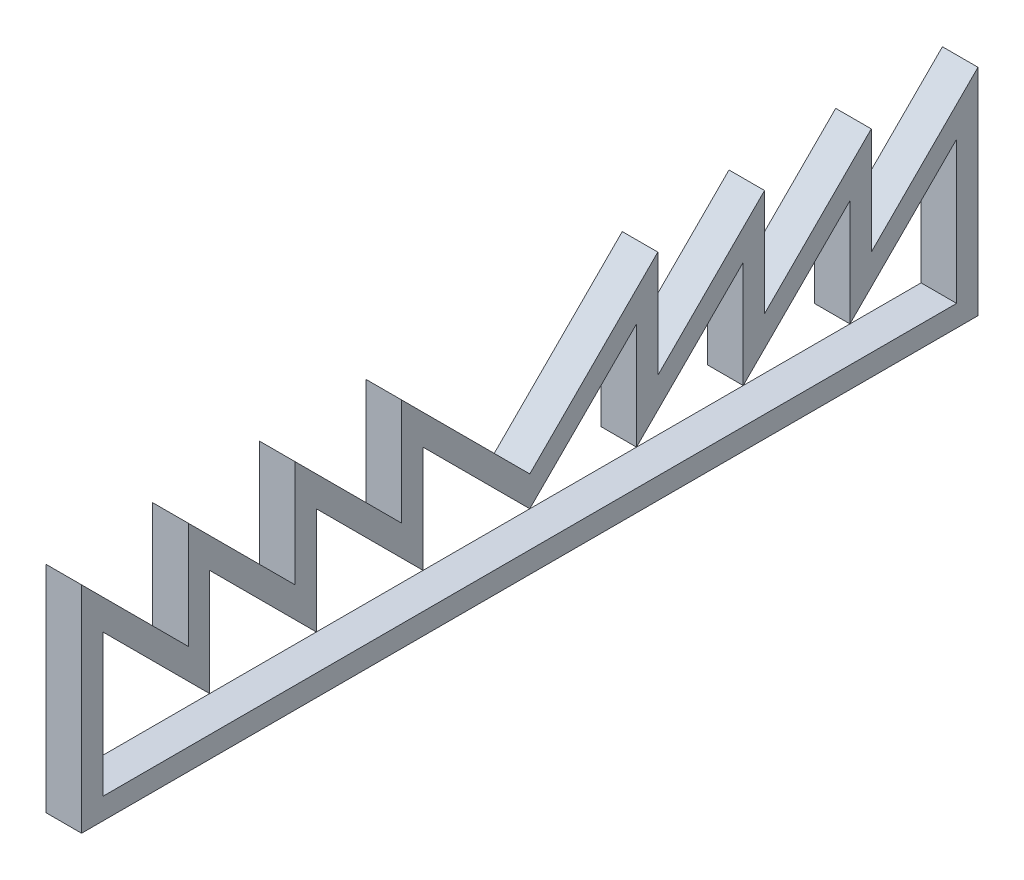
ISO-10303-21;
HEADER;
FILE_DESCRIPTION(('STEP AP214'),'2;1');
FILE_NAME('part.step','',(''),(''),'','','');
FILE_SCHEMA(('AUTOMOTIVE_DESIGN { 1 0 10303 214 1 1 1 1 }'));
ENDSEC;
DATA;
#1=APPLICATION_CONTEXT('core data for automotive mechanical design processes');
#2=APPLICATION_PROTOCOL_DEFINITION('international standard','automotive_design',2000,#1);
#3=PRODUCT_CONTEXT('',#1,'mechanical');
#4=PRODUCT('Part','Part','',(#3));
#5=PRODUCT_RELATED_PRODUCT_CATEGORY('part','',(#4));
#6=PRODUCT_DEFINITION_FORMATION('','',#4);
#7=PRODUCT_DEFINITION_CONTEXT('part definition',#1,'design');
#8=PRODUCT_DEFINITION('design','',#6,#7);
#9=PRODUCT_DEFINITION_SHAPE('','',#8);
#10=(LENGTH_UNIT() NAMED_UNIT(*) SI_UNIT(.MILLI.,.METRE.));
#11=(NAMED_UNIT(*) PLANE_ANGLE_UNIT() SI_UNIT($,.RADIAN.));
#12=(NAMED_UNIT(*) SI_UNIT($,.STERADIAN.) SOLID_ANGLE_UNIT());
#13=UNCERTAINTY_MEASURE_WITH_UNIT(LENGTH_MEASURE(1.E-05),#10,'distance_accuracy_value','');
#14=(GEOMETRIC_REPRESENTATION_CONTEXT(3) GLOBAL_UNCERTAINTY_ASSIGNED_CONTEXT((#13)) GLOBAL_UNIT_ASSIGNED_CONTEXT((#10,
#11,#12)) REPRESENTATION_CONTEXT('',''));
#15=CARTESIAN_POINT('',(0.,0.,0.));
#16=DIRECTION('',(0.,0.,1.));
#17=DIRECTION('',(1.,0.,0.));
#18=AXIS2_PLACEMENT_3D('',#15,#16,#17);
#19=CARTESIAN_POINT('',(12.7,0.,0.));
#20=DIRECTION('',(-1.,0.,0.));
#21=DIRECTION('',(0.,0.,1.));
#22=AXIS2_PLACEMENT_3D('',#19,#20,#21);
#23=PLANE('',#22);
#24=DIRECTION('',(0.,0.,-1.));
#25=VECTOR('',#24,1.);
#26=CARTESIAN_POINT('',(12.7,-7.62,-160.02));
#27=LINE('',#26,#25);
#28=CARTESIAN_POINT('',(12.7,-7.62,160.02));
#29=VERTEX_POINT('',#28);
#30=CARTESIAN_POINT('',(12.7,-7.62,-160.02));
#31=VERTEX_POINT('',#30);
#32=EDGE_CURVE('E382',#29,#31,#27,.T.);
#33=ORIENTED_EDGE('',*,*,#32,.T.);
#34=DIRECTION('',(0.,1.,0.));
#35=VECTOR('',#34,1.);
#36=CARTESIAN_POINT('',(12.7,-7.62,-160.02));
#37=LINE('',#36,#35);
#38=CARTESIAN_POINT('',(12.7,69.1963073452835,-160.02));
#39=VERTEX_POINT('',#38);
#40=EDGE_CURVE('E385',#31,#39,#37,.T.);
#41=ORIENTED_EDGE('',*,*,#40,.T.);
#42=DIRECTION('',(0.,-0.707106781186551,0.707106781186544));
#43=VECTOR('',#42,1.);
#44=CARTESIAN_POINT('',(12.7,69.1963073452835,-160.02));
#45=LINE('',#44,#43);
#46=CARTESIAN_POINT('',(12.7,31.0963073452831,-121.92));
#47=VERTEX_POINT('',#46);
#48=EDGE_CURVE('E388',#39,#47,#45,.T.);
#49=ORIENTED_EDGE('',*,*,#48,.T.);
#50=DIRECTION('',(0.,1.,0.));
#51=VECTOR('',#50,1.);
#52=CARTESIAN_POINT('',(12.7,31.0963073452831,-121.92));
#53=LINE('',#52,#51);
#54=CARTESIAN_POINT('',(12.7,69.1963073452836,-121.92));
#55=VERTEX_POINT('',#54);
#56=EDGE_CURVE('E390',#47,#55,#53,.T.);
#57=ORIENTED_EDGE('',*,*,#56,.T.);
#58=DIRECTION('',(0.,-0.707106781186551,0.707106781186544));
#59=VECTOR('',#58,1.);
#60=CARTESIAN_POINT('',(12.7,69.1963073452836,-121.92));
#61=LINE('',#60,#59);
#62=CARTESIAN_POINT('',(12.7,31.0963073452831,-83.82));
#63=VERTEX_POINT('',#62);
#64=EDGE_CURVE('E392',#55,#63,#61,.T.);
#65=ORIENTED_EDGE('',*,*,#64,.T.);
#66=DIRECTION('',(0.,1.,0.));
#67=VECTOR('',#66,1.);
#68=CARTESIAN_POINT('',(12.7,31.0963073452831,-83.82));
#69=LINE('',#68,#67);
#70=CARTESIAN_POINT('',(12.7,69.1963073452835,-83.82));
#71=VERTEX_POINT('',#70);
#72=EDGE_CURVE('E394',#63,#71,#69,.T.);
#73=ORIENTED_EDGE('',*,*,#72,.T.);
#74=DIRECTION('',(0.,-0.707106781186551,0.707106781186544));
#75=VECTOR('',#74,1.);
#76=CARTESIAN_POINT('',(12.7,69.1963073452835,-83.82));
#77=LINE('',#76,#75);
#78=CARTESIAN_POINT('',(12.7,31.0963073452831,-45.72));
#79=VERTEX_POINT('',#78);
#80=EDGE_CURVE('E396',#71,#79,#77,.T.);
#81=ORIENTED_EDGE('',*,*,#80,.T.);
#82=DIRECTION('',(0.,1.,0.));
#83=VECTOR('',#82,1.);
#84=CARTESIAN_POINT('',(12.7,31.0963073452831,-45.72));
#85=LINE('',#84,#83);
#86=CARTESIAN_POINT('',(12.7,69.1963073452835,-45.72));
#87=VERTEX_POINT('',#86);
#88=EDGE_CURVE('E398',#79,#87,#85,.T.);
#89=ORIENTED_EDGE('',*,*,#88,.T.);
#90=DIRECTION('',(0.,-0.707106781186551,0.707106781186544));
#91=VECTOR('',#90,1.);
#92=CARTESIAN_POINT('',(12.7,69.1963073452835,-45.72));
#93=LINE('',#92,#91);
#94=CARTESIAN_POINT('',(12.7,23.476307345283,0.));
#95=VERTEX_POINT('',#94);
#96=EDGE_CURVE('E400',#87,#95,#93,.T.);
#97=ORIENTED_EDGE('',*,*,#96,.T.);
#98=DIRECTION('',(0.,0.707106781186551,0.707106781186544));
#99=VECTOR('',#98,1.);
#100=CARTESIAN_POINT('',(12.7,69.1963073452835,45.72));
#101=LINE('',#100,#99);
#102=CARTESIAN_POINT('',(12.7,69.1963073452835,45.72));
#103=VERTEX_POINT('',#102);
#104=EDGE_CURVE('E402',#95,#103,#101,.T.);
#105=ORIENTED_EDGE('',*,*,#104,.T.);
#106=DIRECTION('',(0.,-1.,0.));
#107=VECTOR('',#106,1.);
#108=CARTESIAN_POINT('',(12.7,31.0963073452831,45.72));
#109=LINE('',#108,#107);
#110=CARTESIAN_POINT('',(12.7,31.0963073452831,45.72));
#111=VERTEX_POINT('',#110);
#112=EDGE_CURVE('E404',#103,#111,#109,.T.);
#113=ORIENTED_EDGE('',*,*,#112,.T.);
#114=DIRECTION('',(0.,0.707106781186551,0.707106781186544));
#115=VECTOR('',#114,1.);
#116=CARTESIAN_POINT('',(12.7,69.1963073452835,83.82));
#117=LINE('',#116,#115);
#118=CARTESIAN_POINT('',(12.7,69.1963073452835,83.82));
#119=VERTEX_POINT('',#118);
#120=EDGE_CURVE('E406',#111,#119,#117,.T.);
#121=ORIENTED_EDGE('',*,*,#120,.T.);
#122=DIRECTION('',(0.,-1.,0.));
#123=VECTOR('',#122,1.);
#124=CARTESIAN_POINT('',(12.7,31.0963073452831,83.82));
#125=LINE('',#124,#123);
#126=CARTESIAN_POINT('',(12.7,31.0963073452831,83.82));
#127=VERTEX_POINT('',#126);
#128=EDGE_CURVE('E408',#119,#127,#125,.T.);
#129=ORIENTED_EDGE('',*,*,#128,.T.);
#130=DIRECTION('',(0.,0.707106781186551,0.707106781186544));
#131=VECTOR('',#130,1.);
#132=CARTESIAN_POINT('',(12.7,69.1963073452835,121.92));
#133=LINE('',#132,#131);
#134=CARTESIAN_POINT('',(12.7,69.1963073452835,121.92));
#135=VERTEX_POINT('',#134);
#136=EDGE_CURVE('E410',#127,#135,#133,.T.);
#137=ORIENTED_EDGE('',*,*,#136,.T.);
#138=DIRECTION('',(0.,-1.,0.));
#139=VECTOR('',#138,1.);
#140=CARTESIAN_POINT('',(12.7,31.0963073452831,121.92));
#141=LINE('',#140,#139);
#142=CARTESIAN_POINT('',(12.7,31.0963073452831,121.92));
#143=VERTEX_POINT('',#142);
#144=EDGE_CURVE('E412',#135,#143,#141,.T.);
#145=ORIENTED_EDGE('',*,*,#144,.T.);
#146=DIRECTION('',(0.,0.707106781186551,0.707106781186544));
#147=VECTOR('',#146,1.);
#148=CARTESIAN_POINT('',(12.7,69.1963073452835,160.02));
#149=LINE('',#148,#147);
#150=CARTESIAN_POINT('',(12.7,69.1963073452835,160.02));
#151=VERTEX_POINT('',#150);
#152=EDGE_CURVE('E414',#143,#151,#149,.T.);
#153=ORIENTED_EDGE('',*,*,#152,.T.);
#154=DIRECTION('',(0.,-1.,0.));
#155=VECTOR('',#154,1.);
#156=CARTESIAN_POINT('',(12.7,-7.62,160.02));
#157=LINE('',#156,#155);
#158=EDGE_CURVE('E416',#151,#29,#157,.T.);
#159=ORIENTED_EDGE('',*,*,#158,.T.);
#160=EDGE_LOOP('',(#33,#41,#49,#57,#65,#73,#81,#89,#97,#105,#113,#121,#129,#137,#145,#153,#159));
#161=FACE_BOUND('',#160,.T.);
#162=DIRECTION('',(0.,-1.,0.));
#163=VECTOR('',#162,1.);
#164=CARTESIAN_POINT('',(12.7,0.,152.4));
#165=LINE('',#164,#163);
#166=CARTESIAN_POINT('',(12.7,50.8000000000004,152.4));
#167=VERTEX_POINT('',#166);
#168=CARTESIAN_POINT('',(12.7,0.,152.4));
#169=VERTEX_POINT('',#168);
#170=EDGE_CURVE('E254',#167,#169,#165,.T.);
#171=ORIENTED_EDGE('',*,*,#170,.F.);
#172=DIRECTION('',(0.,0.707106781186551,0.707106781186543));
#173=VECTOR('',#172,1.);
#174=CARTESIAN_POINT('',(12.7,50.8000000000004,152.4));
#175=LINE('',#174,#173);
#176=CARTESIAN_POINT('',(12.7,12.7,114.3));
#177=VERTEX_POINT('',#176);
#178=EDGE_CURVE('E305',#177,#167,#175,.T.);
#179=ORIENTED_EDGE('',*,*,#178,.F.);
#180=DIRECTION('',(0.,-1.,0.));
#181=VECTOR('',#180,1.);
#182=CARTESIAN_POINT('',(12.7,12.7,114.3));
#183=LINE('',#182,#181);
#184=CARTESIAN_POINT('',(12.7,50.8000000000004,114.3));
#185=VERTEX_POINT('',#184);
#186=EDGE_CURVE('E303',#185,#177,#183,.T.);
#187=ORIENTED_EDGE('',*,*,#186,.F.);
#188=DIRECTION('',(0.,0.707106781186551,0.707106781186544));
#189=VECTOR('',#188,1.);
#190=CARTESIAN_POINT('',(12.7,50.8000000000004,114.3));
#191=LINE('',#190,#189);
#192=CARTESIAN_POINT('',(12.7,12.7,76.2));
#193=VERTEX_POINT('',#192);
#194=EDGE_CURVE('E301',#193,#185,#191,.T.);
#195=ORIENTED_EDGE('',*,*,#194,.F.);
#196=DIRECTION('',(0.,-1.,0.));
#197=VECTOR('',#196,1.);
#198=CARTESIAN_POINT('',(12.7,12.7,76.2));
#199=LINE('',#198,#197);
#200=CARTESIAN_POINT('',(12.7,50.8000000000004,76.2));
#201=VERTEX_POINT('',#200);
#202=EDGE_CURVE('E299',#201,#193,#199,.T.);
#203=ORIENTED_EDGE('',*,*,#202,.F.);
#204=DIRECTION('',(0.,0.707106781186551,0.707106781186544));
#205=VECTOR('',#204,1.);
#206=CARTESIAN_POINT('',(12.7,50.8000000000004,76.2));
#207=LINE('',#206,#205);
#208=CARTESIAN_POINT('',(12.7,12.7,38.1));
#209=VERTEX_POINT('',#208);
#210=EDGE_CURVE('E297',#209,#201,#207,.T.);
#211=ORIENTED_EDGE('',*,*,#210,.F.);
#212=DIRECTION('',(0.,-1.,0.));
#213=VECTOR('',#212,1.);
#214=CARTESIAN_POINT('',(12.7,12.7,38.1));
#215=LINE('',#214,#213);
#216=CARTESIAN_POINT('',(12.7,50.8000000000004,38.1));
#217=VERTEX_POINT('',#216);
#218=EDGE_CURVE('E295',#217,#209,#215,.T.);
#219=ORIENTED_EDGE('',*,*,#218,.F.);
#220=DIRECTION('',(0.,0.707106781186551,0.707106781186544));
#221=VECTOR('',#220,1.);
#222=CARTESIAN_POINT('',(12.7,50.8000000000004,38.1));
#223=LINE('',#222,#221);
#224=CARTESIAN_POINT('',(12.7,12.7,0.));
#225=VERTEX_POINT('',#224);
#226=EDGE_CURVE('E293',#225,#217,#223,.T.);
#227=ORIENTED_EDGE('',*,*,#226,.F.);
#228=DIRECTION('',(0.,-0.707106781186551,0.707106781186544));
#229=VECTOR('',#228,1.);
#230=CARTESIAN_POINT('',(12.7,50.8000000000004,-38.1));
#231=LINE('',#230,#229);
#232=CARTESIAN_POINT('',(12.7,50.8000000000004,-38.1));
#233=VERTEX_POINT('',#232);
#234=EDGE_CURVE('E291',#233,#225,#231,.T.);
#235=ORIENTED_EDGE('',*,*,#234,.F.);
#236=DIRECTION('',(0.,1.,0.));
#237=VECTOR('',#236,1.);
#238=CARTESIAN_POINT('',(12.7,12.7,-38.1));
#239=LINE('',#238,#237);
#240=CARTESIAN_POINT('',(12.7,12.7,-38.1));
#241=VERTEX_POINT('',#240);
#242=EDGE_CURVE('E289',#241,#233,#239,.T.);
#243=ORIENTED_EDGE('',*,*,#242,.F.);
#244=DIRECTION('',(0.,-0.707106781186551,0.707106781186544));
#245=VECTOR('',#244,1.);
#246=CARTESIAN_POINT('',(12.7,50.8000000000004,-76.2));
#247=LINE('',#246,#245);
#248=CARTESIAN_POINT('',(12.7,50.8000000000004,-76.2));
#249=VERTEX_POINT('',#248);
#250=EDGE_CURVE('E287',#249,#241,#247,.T.);
#251=ORIENTED_EDGE('',*,*,#250,.F.);
#252=DIRECTION('',(0.,1.,0.));
#253=VECTOR('',#252,1.);
#254=CARTESIAN_POINT('',(12.7,12.7,-76.2));
#255=LINE('',#254,#253);
#256=CARTESIAN_POINT('',(12.7,12.7,-76.2));
#257=VERTEX_POINT('',#256);
#258=EDGE_CURVE('E285',#257,#249,#255,.T.);
#259=ORIENTED_EDGE('',*,*,#258,.F.);
#260=DIRECTION('',(0.,-0.707106781186551,0.707106781186544));
#261=VECTOR('',#260,1.);
#262=CARTESIAN_POINT('',(12.7,50.8000000000004,-114.3));
#263=LINE('',#262,#261);
#264=CARTESIAN_POINT('',(12.7,50.8000000000004,-114.3));
#265=VERTEX_POINT('',#264);
#266=EDGE_CURVE('E283',#265,#257,#263,.T.);
#267=ORIENTED_EDGE('',*,*,#266,.F.);
#268=DIRECTION('',(0.,1.,0.));
#269=VECTOR('',#268,1.);
#270=CARTESIAN_POINT('',(12.7,12.7,-114.3));
#271=LINE('',#270,#269);
#272=CARTESIAN_POINT('',(12.7,12.7,-114.3));
#273=VERTEX_POINT('',#272);
#274=EDGE_CURVE('E281',#273,#265,#271,.T.);
#275=ORIENTED_EDGE('',*,*,#274,.F.);
#276=DIRECTION('',(0.,-0.707106781186551,0.707106781186543));
#277=VECTOR('',#276,1.);
#278=CARTESIAN_POINT('',(12.7,50.8000000000004,-152.4));
#279=LINE('',#278,#277);
#280=CARTESIAN_POINT('',(12.7,50.8000000000004,-152.4));
#281=VERTEX_POINT('',#280);
#282=EDGE_CURVE('E277',#281,#273,#279,.T.);
#283=ORIENTED_EDGE('',*,*,#282,.F.);
#284=DIRECTION('',(0.,1.,0.));
#285=VECTOR('',#284,1.);
#286=CARTESIAN_POINT('',(12.7,0.,-152.4));
#287=LINE('',#286,#285);
#288=CARTESIAN_POINT('',(12.7,0.,-152.4));
#289=VERTEX_POINT('',#288);
#290=EDGE_CURVE('E275',#289,#281,#287,.T.);
#291=ORIENTED_EDGE('',*,*,#290,.F.);
#292=DIRECTION('',(0.,0.,-1.));
#293=VECTOR('',#292,1.);
#294=CARTESIAN_POINT('',(12.7,0.,-152.4));
#295=LINE('',#294,#293);
#296=EDGE_CURVE('E262',#169,#289,#295,.T.);
#297=ORIENTED_EDGE('',*,*,#296,.F.);
#298=EDGE_LOOP('',(#171,#179,#187,#195,#203,#211,#219,#227,#235,#243,#251,#259,#267,#275,#283,
#291,#297));
#299=FACE_BOUND('',#298,.T.);
#300=ADVANCED_FACE('F33',(#161,#299),#23,.F.);
#301=CARTESIAN_POINT('',(0.,0.,0.));
#302=DIRECTION('',(-1.,0.,0.));
#303=DIRECTION('',(0.,0.,1.));
#304=AXIS2_PLACEMENT_3D('',#301,#302,#303);
#305=PLANE('',#304);
#306=DIRECTION('',(0.,0.,-1.));
#307=VECTOR('',#306,1.);
#308=CARTESIAN_POINT('',(0.,-7.62,-160.02));
#309=LINE('',#308,#307);
#310=CARTESIAN_POINT('',(0.,-7.62,160.02));
#311=VERTEX_POINT('',#310);
#312=CARTESIAN_POINT('',(0.,-7.62,-160.02));
#313=VERTEX_POINT('',#312);
#314=EDGE_CURVE('E270',#311,#313,#309,.T.);
#315=ORIENTED_EDGE('',*,*,#314,.F.);
#316=DIRECTION('',(0.,-1.,0.));
#317=VECTOR('',#316,1.);
#318=CARTESIAN_POINT('',(0.,-7.62,160.02));
#319=LINE('',#318,#317);
#320=CARTESIAN_POINT('',(0.,69.1963073452835,160.02));
#321=VERTEX_POINT('',#320);
#322=EDGE_CURVE('E386',#321,#311,#319,.T.);
#323=ORIENTED_EDGE('',*,*,#322,.F.);
#324=DIRECTION('',(0.,0.707106781186551,0.707106781186544));
#325=VECTOR('',#324,1.);
#326=CARTESIAN_POINT('',(0.,69.1963073452835,160.02));
#327=LINE('',#326,#325);
#328=CARTESIAN_POINT('',(0.,31.0963073452831,121.92));
#329=VERTEX_POINT('',#328);
#330=EDGE_CURVE('E449',#329,#321,#327,.T.);
#331=ORIENTED_EDGE('',*,*,#330,.F.);
#332=DIRECTION('',(0.,-1.,0.));
#333=VECTOR('',#332,1.);
#334=CARTESIAN_POINT('',(0.,31.0963073452831,121.92));
#335=LINE('',#334,#333);
#336=CARTESIAN_POINT('',(0.,69.1963073452835,121.92));
#337=VERTEX_POINT('',#336);
#338=EDGE_CURVE('E447',#337,#329,#335,.T.);
#339=ORIENTED_EDGE('',*,*,#338,.F.);
#340=DIRECTION('',(0.,0.707106781186551,0.707106781186544));
#341=VECTOR('',#340,1.);
#342=CARTESIAN_POINT('',(0.,69.1963073452835,121.92));
#343=LINE('',#342,#341);
#344=CARTESIAN_POINT('',(0.,31.0963073452831,83.82));
#345=VERTEX_POINT('',#344);
#346=EDGE_CURVE('E445',#345,#337,#343,.T.);
#347=ORIENTED_EDGE('',*,*,#346,.F.);
#348=DIRECTION('',(0.,-1.,0.));
#349=VECTOR('',#348,1.);
#350=CARTESIAN_POINT('',(0.,31.0963073452831,83.82));
#351=LINE('',#350,#349);
#352=CARTESIAN_POINT('',(0.,69.1963073452835,83.82));
#353=VERTEX_POINT('',#352);
#354=EDGE_CURVE('E443',#353,#345,#351,.T.);
#355=ORIENTED_EDGE('',*,*,#354,.F.);
#356=DIRECTION('',(0.,0.707106781186551,0.707106781186544));
#357=VECTOR('',#356,1.);
#358=CARTESIAN_POINT('',(0.,69.1963073452835,83.82));
#359=LINE('',#358,#357);
#360=CARTESIAN_POINT('',(0.,31.0963073452831,45.72));
#361=VERTEX_POINT('',#360);
#362=EDGE_CURVE('E441',#361,#353,#359,.T.);
#363=ORIENTED_EDGE('',*,*,#362,.F.);
#364=DIRECTION('',(0.,-1.,0.));
#365=VECTOR('',#364,1.);
#366=CARTESIAN_POINT('',(0.,31.0963073452831,45.72));
#367=LINE('',#366,#365);
#368=CARTESIAN_POINT('',(0.,69.1963073452835,45.72));
#369=VERTEX_POINT('',#368);
#370=EDGE_CURVE('E439',#369,#361,#367,.T.);
#371=ORIENTED_EDGE('',*,*,#370,.F.);
#372=DIRECTION('',(0.,0.707106781186551,0.707106781186544));
#373=VECTOR('',#372,1.);
#374=CARTESIAN_POINT('',(0.,69.1963073452835,45.72));
#375=LINE('',#374,#373);
#376=CARTESIAN_POINT('',(0.,23.476307345283,0.));
#377=VERTEX_POINT('',#376);
#378=EDGE_CURVE('E437',#377,#369,#375,.T.);
#379=ORIENTED_EDGE('',*,*,#378,.F.);
#380=DIRECTION('',(0.,-0.707106781186551,0.707106781186544));
#381=VECTOR('',#380,1.);
#382=CARTESIAN_POINT('',(0.,69.1963073452835,-45.72));
#383=LINE('',#382,#381);
#384=CARTESIAN_POINT('',(0.,69.1963073452835,-45.72));
#385=VERTEX_POINT('',#384);
#386=EDGE_CURVE('E435',#385,#377,#383,.T.);
#387=ORIENTED_EDGE('',*,*,#386,.F.);
#388=DIRECTION('',(0.,1.,0.));
#389=VECTOR('',#388,1.);
#390=CARTESIAN_POINT('',(0.,31.0963073452831,-45.72));
#391=LINE('',#390,#389);
#392=CARTESIAN_POINT('',(0.,31.0963073452831,-45.72));
#393=VERTEX_POINT('',#392);
#394=EDGE_CURVE('E433',#393,#385,#391,.T.);
#395=ORIENTED_EDGE('',*,*,#394,.F.);
#396=DIRECTION('',(0.,-0.707106781186551,0.707106781186544));
#397=VECTOR('',#396,1.);
#398=CARTESIAN_POINT('',(0.,69.1963073452835,-83.82));
#399=LINE('',#398,#397);
#400=CARTESIAN_POINT('',(0.,69.1963073452835,-83.82));
#401=VERTEX_POINT('',#400);
#402=EDGE_CURVE('E431',#401,#393,#399,.T.);
#403=ORIENTED_EDGE('',*,*,#402,.F.);
#404=DIRECTION('',(0.,1.,0.));
#405=VECTOR('',#404,1.);
#406=CARTESIAN_POINT('',(0.,31.0963073452831,-83.82));
#407=LINE('',#406,#405);
#408=CARTESIAN_POINT('',(0.,31.0963073452831,-83.82));
#409=VERTEX_POINT('',#408);
#410=EDGE_CURVE('E429',#409,#401,#407,.T.);
#411=ORIENTED_EDGE('',*,*,#410,.F.);
#412=DIRECTION('',(0.,-0.707106781186551,0.707106781186544));
#413=VECTOR('',#412,1.);
#414=CARTESIAN_POINT('',(0.,69.1963073452836,-121.92));
#415=LINE('',#414,#413);
#416=CARTESIAN_POINT('',(0.,69.1963073452836,-121.92));
#417=VERTEX_POINT('',#416);
#418=EDGE_CURVE('E427',#417,#409,#415,.T.);
#419=ORIENTED_EDGE('',*,*,#418,.F.);
#420=DIRECTION('',(0.,1.,0.));
#421=VECTOR('',#420,1.);
#422=CARTESIAN_POINT('',(0.,31.0963073452831,-121.92));
#423=LINE('',#422,#421);
#424=CARTESIAN_POINT('',(0.,31.0963073452831,-121.92));
#425=VERTEX_POINT('',#424);
#426=EDGE_CURVE('E425',#425,#417,#423,.T.);
#427=ORIENTED_EDGE('',*,*,#426,.F.);
#428=DIRECTION('',(0.,-0.707106781186551,0.707106781186544));
#429=VECTOR('',#428,1.);
#430=CARTESIAN_POINT('',(0.,69.1963073452835,-160.02));
#431=LINE('',#430,#429);
#432=CARTESIAN_POINT('',(0.,69.1963073452835,-160.02));
#433=VERTEX_POINT('',#432);
#434=EDGE_CURVE('E423',#433,#425,#431,.T.);
#435=ORIENTED_EDGE('',*,*,#434,.F.);
#436=DIRECTION('',(0.,1.,0.));
#437=VECTOR('',#436,1.);
#438=CARTESIAN_POINT('',(0.,-7.62,-160.02));
#439=LINE('',#438,#437);
#440=EDGE_CURVE('E421',#313,#433,#439,.T.);
#441=ORIENTED_EDGE('',*,*,#440,.F.);
#442=EDGE_LOOP('',(#315,#323,#331,#339,#347,#355,#363,#371,#379,#387,#395,#403,#411,#419,#427,
#435,#441));
#443=FACE_BOUND('',#442,.T.);
#444=DIRECTION('',(0.,0.707106781186551,0.707106781186543));
#445=VECTOR('',#444,1.);
#446=CARTESIAN_POINT('',(0.,50.8000000000004,152.4));
#447=LINE('',#446,#445);
#448=CARTESIAN_POINT('',(0.,12.7,114.3));
#449=VERTEX_POINT('',#448);
#450=CARTESIAN_POINT('',(0.,50.8000000000004,152.4));
#451=VERTEX_POINT('',#450);
#452=EDGE_CURVE('E263',#449,#451,#447,.T.);
#453=ORIENTED_EDGE('',*,*,#452,.T.);
#454=DIRECTION('',(0.,-1.,0.));
#455=VECTOR('',#454,1.);
#456=CARTESIAN_POINT('',(0.,0.,152.4));
#457=LINE('',#456,#455);
#458=CARTESIAN_POINT('',(0.,0.,152.4));
#459=VERTEX_POINT('',#458);
#460=EDGE_CURVE('E56',#451,#459,#457,.T.);
#461=ORIENTED_EDGE('',*,*,#460,.T.);
#462=DIRECTION('',(0.,0.,-1.));
#463=VECTOR('',#462,1.);
#464=CARTESIAN_POINT('',(0.,0.,-152.4));
#465=LINE('',#464,#463);
#466=CARTESIAN_POINT('',(0.,0.,-152.4));
#467=VERTEX_POINT('',#466);
#468=EDGE_CURVE('E269',#459,#467,#465,.T.);
#469=ORIENTED_EDGE('',*,*,#468,.T.);
#470=DIRECTION('',(0.,1.,0.));
#471=VECTOR('',#470,1.);
#472=CARTESIAN_POINT('',(0.,0.,-152.4));
#473=LINE('',#472,#471);
#474=CARTESIAN_POINT('',(0.,50.8000000000004,-152.4));
#475=VERTEX_POINT('',#474);
#476=EDGE_CURVE('E309',#467,#475,#473,.T.);
#477=ORIENTED_EDGE('',*,*,#476,.T.);
#478=DIRECTION('',(0.,-0.707106781186551,0.707106781186543));
#479=VECTOR('',#478,1.);
#480=CARTESIAN_POINT('',(0.,50.8000000000004,-152.4));
#481=LINE('',#480,#479);
#482=CARTESIAN_POINT('',(0.,12.7,-114.3));
#483=VERTEX_POINT('',#482);
#484=EDGE_CURVE('E312',#475,#483,#481,.T.);
#485=ORIENTED_EDGE('',*,*,#484,.T.);
#486=DIRECTION('',(0.,1.,0.));
#487=VECTOR('',#486,1.);
#488=CARTESIAN_POINT('',(0.,12.7,-114.3));
#489=LINE('',#488,#487);
#490=CARTESIAN_POINT('',(0.,50.8000000000004,-114.3));
#491=VERTEX_POINT('',#490);
#492=EDGE_CURVE('E315',#483,#491,#489,.T.);
#493=ORIENTED_EDGE('',*,*,#492,.T.);
#494=DIRECTION('',(0.,-0.707106781186551,0.707106781186544));
#495=VECTOR('',#494,1.);
#496=CARTESIAN_POINT('',(0.,50.8000000000004,-114.3));
#497=LINE('',#496,#495);
#498=CARTESIAN_POINT('',(0.,12.7,-76.2));
#499=VERTEX_POINT('',#498);
#500=EDGE_CURVE('E318',#491,#499,#497,.T.);
#501=ORIENTED_EDGE('',*,*,#500,.T.);
#502=DIRECTION('',(0.,1.,0.));
#503=VECTOR('',#502,1.);
#504=CARTESIAN_POINT('',(0.,12.7,-76.2));
#505=LINE('',#504,#503);
#506=CARTESIAN_POINT('',(0.,50.8000000000004,-76.2));
#507=VERTEX_POINT('',#506);
#508=EDGE_CURVE('E321',#499,#507,#505,.T.);
#509=ORIENTED_EDGE('',*,*,#508,.T.);
#510=DIRECTION('',(0.,-0.707106781186551,0.707106781186544));
#511=VECTOR('',#510,1.);
#512=CARTESIAN_POINT('',(0.,50.8000000000004,-76.2));
#513=LINE('',#512,#511);
#514=CARTESIAN_POINT('',(0.,12.7,-38.1));
#515=VERTEX_POINT('',#514);
#516=EDGE_CURVE('E324',#507,#515,#513,.T.);
#517=ORIENTED_EDGE('',*,*,#516,.T.);
#518=DIRECTION('',(0.,1.,0.));
#519=VECTOR('',#518,1.);
#520=CARTESIAN_POINT('',(0.,12.7,-38.1));
#521=LINE('',#520,#519);
#522=CARTESIAN_POINT('',(0.,50.8000000000004,-38.1));
#523=VERTEX_POINT('',#522);
#524=EDGE_CURVE('E327',#515,#523,#521,.T.);
#525=ORIENTED_EDGE('',*,*,#524,.T.);
#526=DIRECTION('',(0.,-0.707106781186551,0.707106781186544));
#527=VECTOR('',#526,1.);
#528=CARTESIAN_POINT('',(0.,50.8000000000004,-38.1));
#529=LINE('',#528,#527);
#530=CARTESIAN_POINT('',(0.,12.7,0.));
#531=VERTEX_POINT('',#530);
#532=EDGE_CURVE('E330',#523,#531,#529,.T.);
#533=ORIENTED_EDGE('',*,*,#532,.T.);
#534=DIRECTION('',(0.,0.707106781186551,0.707106781186544));
#535=VECTOR('',#534,1.);
#536=CARTESIAN_POINT('',(0.,50.8000000000004,38.1));
#537=LINE('',#536,#535);
#538=CARTESIAN_POINT('',(0.,50.8000000000004,38.1));
#539=VERTEX_POINT('',#538);
#540=EDGE_CURVE('E333',#531,#539,#537,.T.);
#541=ORIENTED_EDGE('',*,*,#540,.T.);
#542=DIRECTION('',(0.,-1.,0.));
#543=VECTOR('',#542,1.);
#544=CARTESIAN_POINT('',(0.,12.7,38.1));
#545=LINE('',#544,#543);
#546=CARTESIAN_POINT('',(0.,12.7,38.1));
#547=VERTEX_POINT('',#546);
#548=EDGE_CURVE('E336',#539,#547,#545,.T.);
#549=ORIENTED_EDGE('',*,*,#548,.T.);
#550=DIRECTION('',(0.,0.707106781186551,0.707106781186544));
#551=VECTOR('',#550,1.);
#552=CARTESIAN_POINT('',(0.,50.8000000000004,76.2));
#553=LINE('',#552,#551);
#554=CARTESIAN_POINT('',(0.,50.8000000000004,76.2));
#555=VERTEX_POINT('',#554);
#556=EDGE_CURVE('E339',#547,#555,#553,.T.);
#557=ORIENTED_EDGE('',*,*,#556,.T.);
#558=DIRECTION('',(0.,-1.,0.));
#559=VECTOR('',#558,1.);
#560=CARTESIAN_POINT('',(0.,12.7,76.2));
#561=LINE('',#560,#559);
#562=CARTESIAN_POINT('',(0.,12.7,76.2));
#563=VERTEX_POINT('',#562);
#564=EDGE_CURVE('E342',#555,#563,#561,.T.);
#565=ORIENTED_EDGE('',*,*,#564,.T.);
#566=DIRECTION('',(0.,0.707106781186551,0.707106781186544));
#567=VECTOR('',#566,1.);
#568=CARTESIAN_POINT('',(0.,50.8000000000004,114.3));
#569=LINE('',#568,#567);
#570=CARTESIAN_POINT('',(0.,50.8000000000004,114.3));
#571=VERTEX_POINT('',#570);
#572=EDGE_CURVE('E345',#563,#571,#569,.T.);
#573=ORIENTED_EDGE('',*,*,#572,.T.);
#574=DIRECTION('',(0.,-1.,0.));
#575=VECTOR('',#574,1.);
#576=CARTESIAN_POINT('',(0.,12.7,114.3));
#577=LINE('',#576,#575);
#578=EDGE_CURVE('E348',#571,#449,#577,.T.);
#579=ORIENTED_EDGE('',*,*,#578,.T.);
#580=EDGE_LOOP('',(#453,#461,#469,#477,#485,#493,#501,#509,#517,#525,#533,#541,#549,#557,#565,
#573,#579));
#581=FACE_BOUND('',#580,.T.);
#582=ADVANCED_FACE('F506',(#443,#581),#305,.T.);
#583=CARTESIAN_POINT('',(12.7,-7.62,-160.02));
#584=DIRECTION('',(0.,1.,0.));
#585=DIRECTION('',(0.,0.,1.));
#586=AXIS2_PLACEMENT_3D('',#583,#584,#585);
#587=PLANE('',#586);
#588=ORIENTED_EDGE('',*,*,#314,.T.);
#589=DIRECTION('',(-1.,0.,0.));
#590=VECTOR('',#589,1.);
#591=CARTESIAN_POINT('',(12.7,-7.62,-160.02));
#592=LINE('',#591,#590);
#593=EDGE_CURVE('E11',#31,#313,#592,.T.);
#594=ORIENTED_EDGE('',*,*,#593,.F.);
#595=ORIENTED_EDGE('',*,*,#32,.F.);
#596=DIRECTION('',(-1.,0.,0.));
#597=VECTOR('',#596,1.);
#598=CARTESIAN_POINT('',(12.7,-7.62,160.02));
#599=LINE('',#598,#597);
#600=EDGE_CURVE('E418',#29,#311,#599,.T.);
#601=ORIENTED_EDGE('',*,*,#600,.T.);
#602=EDGE_LOOP('',(#588,#594,#595,#601));
#603=FACE_BOUND('',#602,.T.);
#604=ADVANCED_FACE('F35',(#603),#587,.F.);
#605=CARTESIAN_POINT('',(12.7,-7.62,-160.02));
#606=DIRECTION('',(0.,0.,1.));
#607=DIRECTION('',(1.,0.,0.));
#608=AXIS2_PLACEMENT_3D('',#605,#606,#607);
#609=PLANE('',#608);
#610=ORIENTED_EDGE('',*,*,#440,.T.);
#611=DIRECTION('',(-1.,0.,0.));
#612=VECTOR('',#611,1.);
#613=CARTESIAN_POINT('',(12.7,69.1963073452835,-160.02));
#614=LINE('',#613,#612);
#615=EDGE_CURVE('E41',#39,#433,#614,.T.);
#616=ORIENTED_EDGE('',*,*,#615,.F.);
#617=ORIENTED_EDGE('',*,*,#40,.F.);
#618=ORIENTED_EDGE('',*,*,#593,.T.);
#619=EDGE_LOOP('',(#610,#616,#617,#618));
#620=FACE_BOUND('',#619,.T.);
#621=ADVANCED_FACE('F523',(#620),#609,.F.);
#622=CARTESIAN_POINT('',(12.7,69.1963073452835,-160.02));
#623=DIRECTION('',(0.,-0.707106781186544,-0.707106781186551));
#624=DIRECTION('',(0.,0.707106781186551,-0.707106781186544));
#625=AXIS2_PLACEMENT_3D('',#622,#623,#624);
#626=PLANE('',#625);
#627=ORIENTED_EDGE('',*,*,#434,.T.);
#628=DIRECTION('',(-1.,0.,0.));
#629=VECTOR('',#628,1.);
#630=CARTESIAN_POINT('',(12.7,31.0963073452831,-121.92));
#631=LINE('',#630,#629);
#632=EDGE_CURVE('E493',#47,#425,#631,.T.);
#633=ORIENTED_EDGE('',*,*,#632,.F.);
#634=ORIENTED_EDGE('',*,*,#48,.F.);
#635=ORIENTED_EDGE('',*,*,#615,.T.);
#636=EDGE_LOOP('',(#627,#633,#634,#635));
#637=FACE_BOUND('',#636,.T.);
#638=ADVANCED_FACE('F500',(#637),#626,.F.);
#639=CARTESIAN_POINT('',(12.7,31.0963073452831,-121.92));
#640=DIRECTION('',(0.,0.,1.));
#641=DIRECTION('',(1.,0.,0.));
#642=AXIS2_PLACEMENT_3D('',#639,#640,#641);
#643=PLANE('',#642);
#644=ORIENTED_EDGE('',*,*,#426,.T.);
#645=DIRECTION('',(-1.,0.,0.));
#646=VECTOR('',#645,1.);
#647=CARTESIAN_POINT('',(12.7,69.1963073452836,-121.92));
#648=LINE('',#647,#646);
#649=EDGE_CURVE('E490',#55,#417,#648,.T.);
#650=ORIENTED_EDGE('',*,*,#649,.F.);
#651=ORIENTED_EDGE('',*,*,#56,.F.);
#652=ORIENTED_EDGE('',*,*,#632,.T.);
#653=EDGE_LOOP('',(#644,#650,#651,#652));
#654=FACE_BOUND('',#653,.T.);
#655=ADVANCED_FACE('F512',(#654),#643,.F.);
#656=CARTESIAN_POINT('',(12.7,69.1963073452836,-121.92));
#657=DIRECTION('',(0.,-0.707106781186544,-0.707106781186551));
#658=DIRECTION('',(0.,0.707106781186551,-0.707106781186544));
#659=AXIS2_PLACEMENT_3D('',#656,#657,#658);
#660=PLANE('',#659);
#661=ORIENTED_EDGE('',*,*,#418,.T.);
#662=DIRECTION('',(-1.,0.,0.));
#663=VECTOR('',#662,1.);
#664=CARTESIAN_POINT('',(12.7,31.0963073452831,-83.82));
#665=LINE('',#664,#663);
#666=EDGE_CURVE('E487',#63,#409,#665,.T.);
#667=ORIENTED_EDGE('',*,*,#666,.F.);
#668=ORIENTED_EDGE('',*,*,#64,.F.);
#669=ORIENTED_EDGE('',*,*,#649,.T.);
#670=EDGE_LOOP('',(#661,#667,#668,#669));
#671=FACE_BOUND('',#670,.T.);
#672=ADVANCED_FACE('F516',(#671),#660,.F.);
#673=CARTESIAN_POINT('',(12.7,31.0963073452831,-83.82));
#674=DIRECTION('',(0.,0.,1.));
#675=DIRECTION('',(1.,0.,0.));
#676=AXIS2_PLACEMENT_3D('',#673,#674,#675);
#677=PLANE('',#676);
#678=ORIENTED_EDGE('',*,*,#410,.T.);
#679=DIRECTION('',(-1.,0.,0.));
#680=VECTOR('',#679,1.);
#681=CARTESIAN_POINT('',(12.7,69.1963073452835,-83.82));
#682=LINE('',#681,#680);
#683=EDGE_CURVE('E484',#71,#401,#682,.T.);
#684=ORIENTED_EDGE('',*,*,#683,.F.);
#685=ORIENTED_EDGE('',*,*,#72,.F.);
#686=ORIENTED_EDGE('',*,*,#666,.T.);
#687=EDGE_LOOP('',(#678,#684,#685,#686));
#688=FACE_BOUND('',#687,.T.);
#689=ADVANCED_FACE('F581',(#688),#677,.F.);
#690=CARTESIAN_POINT('',(12.7,69.1963073452835,-83.82));
#691=DIRECTION('',(0.,-0.707106781186544,-0.707106781186551));
#692=DIRECTION('',(0.,0.707106781186551,-0.707106781186544));
#693=AXIS2_PLACEMENT_3D('',#690,#691,#692);
#694=PLANE('',#693);
#695=ORIENTED_EDGE('',*,*,#402,.T.);
#696=DIRECTION('',(-1.,0.,0.));
#697=VECTOR('',#696,1.);
#698=CARTESIAN_POINT('',(12.7,31.0963073452831,-45.72));
#699=LINE('',#698,#697);
#700=EDGE_CURVE('E481',#79,#393,#699,.T.);
#701=ORIENTED_EDGE('',*,*,#700,.F.);
#702=ORIENTED_EDGE('',*,*,#80,.F.);
#703=ORIENTED_EDGE('',*,*,#683,.T.);
#704=EDGE_LOOP('',(#695,#701,#702,#703));
#705=FACE_BOUND('',#704,.T.);
#706=ADVANCED_FACE('F579',(#705),#694,.F.);
#707=CARTESIAN_POINT('',(12.7,31.0963073452831,-45.72));
#708=DIRECTION('',(0.,0.,1.));
#709=DIRECTION('',(1.,0.,0.));
#710=AXIS2_PLACEMENT_3D('',#707,#708,#709);
#711=PLANE('',#710);
#712=ORIENTED_EDGE('',*,*,#394,.T.);
#713=DIRECTION('',(-1.,0.,0.));
#714=VECTOR('',#713,1.);
#715=CARTESIAN_POINT('',(12.7,69.1963073452835,-45.72));
#716=LINE('',#715,#714);
#717=EDGE_CURVE('E478',#87,#385,#716,.T.);
#718=ORIENTED_EDGE('',*,*,#717,.F.);
#719=ORIENTED_EDGE('',*,*,#88,.F.);
#720=ORIENTED_EDGE('',*,*,#700,.T.);
#721=EDGE_LOOP('',(#712,#718,#719,#720));
#722=FACE_BOUND('',#721,.T.);
#723=ADVANCED_FACE('F574',(#722),#711,.F.);
#724=CARTESIAN_POINT('',(12.7,69.1963073452835,-45.72));
#725=DIRECTION('',(0.,-0.707106781186544,-0.707106781186551));
#726=DIRECTION('',(0.,0.707106781186551,-0.707106781186544));
#727=AXIS2_PLACEMENT_3D('',#724,#725,#726);
#728=PLANE('',#727);
#729=ORIENTED_EDGE('',*,*,#386,.T.);
#730=DIRECTION('',(-1.,0.,0.));
#731=VECTOR('',#730,1.);
#732=CARTESIAN_POINT('',(12.7,23.476307345283,0.));
#733=LINE('',#732,#731);
#734=EDGE_CURVE('E475',#95,#377,#733,.T.);
#735=ORIENTED_EDGE('',*,*,#734,.F.);
#736=ORIENTED_EDGE('',*,*,#96,.F.);
#737=ORIENTED_EDGE('',*,*,#717,.T.);
#738=EDGE_LOOP('',(#729,#735,#736,#737));
#739=FACE_BOUND('',#738,.T.);
#740=ADVANCED_FACE('F569',(#739),#728,.F.);
#741=CARTESIAN_POINT('',(12.7,69.1963073452835,45.72));
#742=DIRECTION('',(0.,-0.707106781186544,0.707106781186551));
#743=DIRECTION('',(0.,-0.707106781186551,-0.707106781186544));
#744=AXIS2_PLACEMENT_3D('',#741,#742,#743);
#745=PLANE('',#744);
#746=ORIENTED_EDGE('',*,*,#378,.T.);
#747=DIRECTION('',(-1.,0.,0.));
#748=VECTOR('',#747,1.);
#749=CARTESIAN_POINT('',(12.7,69.1963073452835,45.72));
#750=LINE('',#749,#748);
#751=EDGE_CURVE('E472',#103,#369,#750,.T.);
#752=ORIENTED_EDGE('',*,*,#751,.F.);
#753=ORIENTED_EDGE('',*,*,#104,.F.);
#754=ORIENTED_EDGE('',*,*,#734,.T.);
#755=EDGE_LOOP('',(#746,#752,#753,#754));
#756=FACE_BOUND('',#755,.T.);
#757=ADVANCED_FACE('F565',(#756),#745,.F.);
#758=CARTESIAN_POINT('',(12.7,31.0963073452831,45.72));
#759=DIRECTION('',(0.,0.,-1.));
#760=DIRECTION('',(-1.,0.,0.));
#761=AXIS2_PLACEMENT_3D('',#758,#759,#760);
#762=PLANE('',#761);
#763=ORIENTED_EDGE('',*,*,#370,.T.);
#764=DIRECTION('',(-1.,0.,0.));
#765=VECTOR('',#764,1.);
#766=CARTESIAN_POINT('',(12.7,31.0963073452831,45.72));
#767=LINE('',#766,#765);
#768=EDGE_CURVE('E469',#111,#361,#767,.T.);
#769=ORIENTED_EDGE('',*,*,#768,.F.);
#770=ORIENTED_EDGE('',*,*,#112,.F.);
#771=ORIENTED_EDGE('',*,*,#751,.T.);
#772=EDGE_LOOP('',(#763,#769,#770,#771));
#773=FACE_BOUND('',#772,.T.);
#774=ADVANCED_FACE('F560',(#773),#762,.F.);
#775=CARTESIAN_POINT('',(12.7,69.1963073452835,83.82));
#776=DIRECTION('',(0.,-0.707106781186544,0.707106781186551));
#777=DIRECTION('',(0.,-0.707106781186551,-0.707106781186544));
#778=AXIS2_PLACEMENT_3D('',#775,#776,#777);
#779=PLANE('',#778);
#780=ORIENTED_EDGE('',*,*,#362,.T.);
#781=DIRECTION('',(-1.,0.,0.));
#782=VECTOR('',#781,1.);
#783=CARTESIAN_POINT('',(12.7,69.1963073452835,83.82));
#784=LINE('',#783,#782);
#785=EDGE_CURVE('E466',#119,#353,#784,.T.);
#786=ORIENTED_EDGE('',*,*,#785,.F.);
#787=ORIENTED_EDGE('',*,*,#120,.F.);
#788=ORIENTED_EDGE('',*,*,#768,.T.);
#789=EDGE_LOOP('',(#780,#786,#787,#788));
#790=FACE_BOUND('',#789,.T.);
#791=ADVANCED_FACE('F554',(#790),#779,.F.);
#792=CARTESIAN_POINT('',(12.7,31.0963073452831,83.82));
#793=DIRECTION('',(0.,0.,-1.));
#794=DIRECTION('',(-1.,0.,0.));
#795=AXIS2_PLACEMENT_3D('',#792,#793,#794);
#796=PLANE('',#795);
#797=ORIENTED_EDGE('',*,*,#354,.T.);
#798=DIRECTION('',(-1.,0.,0.));
#799=VECTOR('',#798,1.);
#800=CARTESIAN_POINT('',(12.7,31.0963073452831,83.82));
#801=LINE('',#800,#799);
#802=EDGE_CURVE('E463',#127,#345,#801,.T.);
#803=ORIENTED_EDGE('',*,*,#802,.F.);
#804=ORIENTED_EDGE('',*,*,#128,.F.);
#805=ORIENTED_EDGE('',*,*,#785,.T.);
#806=EDGE_LOOP('',(#797,#803,#804,#805));
#807=FACE_BOUND('',#806,.T.);
#808=ADVANCED_FACE('F550',(#807),#796,.F.);
#809=CARTESIAN_POINT('',(12.7,69.1963073452835,121.92));
#810=DIRECTION('',(0.,-0.707106781186544,0.707106781186551));
#811=DIRECTION('',(0.,-0.707106781186551,-0.707106781186544));
#812=AXIS2_PLACEMENT_3D('',#809,#810,#811);
#813=PLANE('',#812);
#814=ORIENTED_EDGE('',*,*,#346,.T.);
#815=DIRECTION('',(-1.,0.,0.));
#816=VECTOR('',#815,1.);
#817=CARTESIAN_POINT('',(12.7,69.1963073452835,121.92));
#818=LINE('',#817,#816);
#819=EDGE_CURVE('E460',#135,#337,#818,.T.);
#820=ORIENTED_EDGE('',*,*,#819,.F.);
#821=ORIENTED_EDGE('',*,*,#136,.F.);
#822=ORIENTED_EDGE('',*,*,#802,.T.);
#823=EDGE_LOOP('',(#814,#820,#821,#822));
#824=FACE_BOUND('',#823,.T.);
#825=ADVANCED_FACE('F545',(#824),#813,.F.);
#826=CARTESIAN_POINT('',(12.7,31.0963073452831,121.92));
#827=DIRECTION('',(0.,0.,-1.));
#828=DIRECTION('',(-1.,0.,0.));
#829=AXIS2_PLACEMENT_3D('',#826,#827,#828);
#830=PLANE('',#829);
#831=ORIENTED_EDGE('',*,*,#338,.T.);
#832=DIRECTION('',(-1.,0.,0.));
#833=VECTOR('',#832,1.);
#834=CARTESIAN_POINT('',(12.7,31.0963073452831,121.92));
#835=LINE('',#834,#833);
#836=EDGE_CURVE('E457',#143,#329,#835,.T.);
#837=ORIENTED_EDGE('',*,*,#836,.F.);
#838=ORIENTED_EDGE('',*,*,#144,.F.);
#839=ORIENTED_EDGE('',*,*,#819,.T.);
#840=EDGE_LOOP('',(#831,#837,#838,#839));
#841=FACE_BOUND('',#840,.T.);
#842=ADVANCED_FACE('F539',(#841),#830,.F.);
#843=CARTESIAN_POINT('',(12.7,69.1963073452835,160.02));
#844=DIRECTION('',(0.,-0.707106781186544,0.707106781186551));
#845=DIRECTION('',(0.,-0.707106781186551,-0.707106781186544));
#846=AXIS2_PLACEMENT_3D('',#843,#844,#845);
#847=PLANE('',#846);
#848=ORIENTED_EDGE('',*,*,#330,.T.);
#849=DIRECTION('',(-1.,0.,0.));
#850=VECTOR('',#849,1.);
#851=CARTESIAN_POINT('',(12.7,69.1963073452835,160.02));
#852=LINE('',#851,#850);
#853=EDGE_CURVE('E454',#151,#321,#852,.T.);
#854=ORIENTED_EDGE('',*,*,#853,.F.);
#855=ORIENTED_EDGE('',*,*,#152,.F.);
#856=ORIENTED_EDGE('',*,*,#836,.T.);
#857=EDGE_LOOP('',(#848,#854,#855,#856));
#858=FACE_BOUND('',#857,.T.);
#859=ADVANCED_FACE('F535',(#858),#847,.F.);
#860=CARTESIAN_POINT('',(12.7,-7.62,160.02));
#861=DIRECTION('',(0.,0.,-1.));
#862=DIRECTION('',(-1.,0.,0.));
#863=AXIS2_PLACEMENT_3D('',#860,#861,#862);
#864=PLANE('',#863);
#865=ORIENTED_EDGE('',*,*,#322,.T.);
#866=ORIENTED_EDGE('',*,*,#600,.F.);
#867=ORIENTED_EDGE('',*,*,#158,.F.);
#868=ORIENTED_EDGE('',*,*,#853,.T.);
#869=EDGE_LOOP('',(#865,#866,#867,#868));
#870=FACE_BOUND('',#869,.T.);
#871=ADVANCED_FACE('F530',(#870),#864,.F.);
#872=CARTESIAN_POINT('',(12.7,0.,152.4));
#873=DIRECTION('',(0.,0.,-1.));
#874=DIRECTION('',(-1.,0.,0.));
#875=AXIS2_PLACEMENT_3D('',#872,#873,#874);
#876=PLANE('',#875);
#877=ORIENTED_EDGE('',*,*,#460,.F.);
#878=DIRECTION('',(-1.,0.,0.));
#879=VECTOR('',#878,1.);
#880=CARTESIAN_POINT('',(12.7,50.8000000000004,152.4));
#881=LINE('',#880,#879);
#882=EDGE_CURVE('E258',#167,#451,#881,.T.);
#883=ORIENTED_EDGE('',*,*,#882,.F.);
#884=ORIENTED_EDGE('',*,*,#170,.T.);
#885=DIRECTION('',(-1.,0.,0.));
#886=VECTOR('',#885,1.);
#887=CARTESIAN_POINT('',(12.7,0.,152.4));
#888=LINE('',#887,#886);
#889=EDGE_CURVE('E257',#169,#459,#888,.T.);
#890=ORIENTED_EDGE('',*,*,#889,.T.);
#891=EDGE_LOOP('',(#877,#883,#884,#890));
#892=FACE_BOUND('',#891,.T.);
#893=ADVANCED_FACE('F256',(#892),#876,.T.);
#894=CARTESIAN_POINT('',(12.7,0.,-152.4));
#895=DIRECTION('',(0.,1.,0.));
#896=DIRECTION('',(0.,0.,1.));
#897=AXIS2_PLACEMENT_3D('',#894,#895,#896);
#898=PLANE('',#897);
#899=ORIENTED_EDGE('',*,*,#468,.F.);
#900=ORIENTED_EDGE('',*,*,#889,.F.);
#901=ORIENTED_EDGE('',*,*,#296,.T.);
#902=DIRECTION('',(-1.,0.,0.));
#903=VECTOR('',#902,1.);
#904=CARTESIAN_POINT('',(12.7,0.,-152.4));
#905=LINE('',#904,#903);
#906=EDGE_CURVE('E271',#289,#467,#905,.T.);
#907=ORIENTED_EDGE('',*,*,#906,.T.);
#908=EDGE_LOOP('',(#899,#900,#901,#907));
#909=FACE_BOUND('',#908,.T.);
#910=ADVANCED_FACE('F266',(#909),#898,.T.);
#911=CARTESIAN_POINT('',(12.7,0.,-152.4));
#912=DIRECTION('',(0.,0.,1.));
#913=DIRECTION('',(1.,0.,0.));
#914=AXIS2_PLACEMENT_3D('',#911,#912,#913);
#915=PLANE('',#914);
#916=ORIENTED_EDGE('',*,*,#476,.F.);
#917=ORIENTED_EDGE('',*,*,#906,.F.);
#918=ORIENTED_EDGE('',*,*,#290,.T.);
#919=DIRECTION('',(-1.,0.,0.));
#920=VECTOR('',#919,1.);
#921=CARTESIAN_POINT('',(12.7,50.8000000000004,-152.4));
#922=LINE('',#921,#920);
#923=EDGE_CURVE('E379',#281,#475,#922,.T.);
#924=ORIENTED_EDGE('',*,*,#923,.T.);
#925=EDGE_LOOP('',(#916,#917,#918,#924));
#926=FACE_BOUND('',#925,.T.);
#927=ADVANCED_FACE('F669',(#926),#915,.T.);
#928=CARTESIAN_POINT('',(12.7,50.8000000000004,-152.4));
#929=DIRECTION('',(0.,-0.707106781186543,-0.707106781186551));
#930=DIRECTION('',(0.,0.707106781186551,-0.707106781186544));
#931=AXIS2_PLACEMENT_3D('',#928,#929,#930);
#932=PLANE('',#931);
#933=ORIENTED_EDGE('',*,*,#484,.F.);
#934=ORIENTED_EDGE('',*,*,#923,.F.);
#935=ORIENTED_EDGE('',*,*,#282,.T.);
#936=DIRECTION('',(-1.,0.,0.));
#937=VECTOR('',#936,1.);
#938=CARTESIAN_POINT('',(12.7,12.7,-114.3));
#939=LINE('',#938,#937);
#940=EDGE_CURVE('E377',#273,#483,#939,.T.);
#941=ORIENTED_EDGE('',*,*,#940,.T.);
#942=EDGE_LOOP('',(#933,#934,#935,#941));
#943=FACE_BOUND('',#942,.T.);
#944=ADVANCED_FACE('F675',(#943),#932,.T.);
#945=CARTESIAN_POINT('',(12.7,12.7,-114.3));
#946=DIRECTION('',(0.,0.,1.));
#947=DIRECTION('',(1.,0.,0.));
#948=AXIS2_PLACEMENT_3D('',#945,#946,#947);
#949=PLANE('',#948);
#950=ORIENTED_EDGE('',*,*,#492,.F.);
#951=ORIENTED_EDGE('',*,*,#940,.F.);
#952=ORIENTED_EDGE('',*,*,#274,.T.);
#953=DIRECTION('',(-1.,0.,0.));
#954=VECTOR('',#953,1.);
#955=CARTESIAN_POINT('',(12.7,50.8000000000004,-114.3));
#956=LINE('',#955,#954);
#957=EDGE_CURVE('E375',#265,#491,#956,.T.);
#958=ORIENTED_EDGE('',*,*,#957,.T.);
#959=EDGE_LOOP('',(#950,#951,#952,#958));
#960=FACE_BOUND('',#959,.T.);
#961=ADVANCED_FACE('F683',(#960),#949,.T.);
#962=CARTESIAN_POINT('',(12.7,50.8000000000004,-114.3));
#963=DIRECTION('',(0.,-0.707106781186544,-0.707106781186551));
#964=DIRECTION('',(0.,0.707106781186551,-0.707106781186544));
#965=AXIS2_PLACEMENT_3D('',#962,#963,#964);
#966=PLANE('',#965);
#967=ORIENTED_EDGE('',*,*,#500,.F.);
#968=ORIENTED_EDGE('',*,*,#957,.F.);
#969=ORIENTED_EDGE('',*,*,#266,.T.);
#970=DIRECTION('',(-1.,0.,0.));
#971=VECTOR('',#970,1.);
#972=CARTESIAN_POINT('',(12.7,12.7,-76.2));
#973=LINE('',#972,#971);
#974=EDGE_CURVE('E373',#257,#499,#973,.T.);
#975=ORIENTED_EDGE('',*,*,#974,.T.);
#976=EDGE_LOOP('',(#967,#968,#969,#975));
#977=FACE_BOUND('',#976,.T.);
#978=ADVANCED_FACE('F691',(#977),#966,.T.);
#979=CARTESIAN_POINT('',(12.7,12.7,-76.2));
#980=DIRECTION('',(0.,0.,1.));
#981=DIRECTION('',(1.,0.,0.));
#982=AXIS2_PLACEMENT_3D('',#979,#980,#981);
#983=PLANE('',#982);
#984=ORIENTED_EDGE('',*,*,#508,.F.);
#985=ORIENTED_EDGE('',*,*,#974,.F.);
#986=ORIENTED_EDGE('',*,*,#258,.T.);
#987=DIRECTION('',(-1.,0.,0.));
#988=VECTOR('',#987,1.);
#989=CARTESIAN_POINT('',(12.7,50.8000000000004,-76.2));
#990=LINE('',#989,#988);
#991=EDGE_CURVE('E371',#249,#507,#990,.T.);
#992=ORIENTED_EDGE('',*,*,#991,.T.);
#993=EDGE_LOOP('',(#984,#985,#986,#992));
#994=FACE_BOUND('',#993,.T.);
#995=ADVANCED_FACE('F699',(#994),#983,.T.);
#996=CARTESIAN_POINT('',(12.7,50.8000000000004,-76.2));
#997=DIRECTION('',(0.,-0.707106781186544,-0.707106781186551));
#998=DIRECTION('',(0.,0.707106781186551,-0.707106781186544));
#999=AXIS2_PLACEMENT_3D('',#996,#997,#998);
#1000=PLANE('',#999);
#1001=ORIENTED_EDGE('',*,*,#516,.F.);
#1002=ORIENTED_EDGE('',*,*,#991,.F.);
#1003=ORIENTED_EDGE('',*,*,#250,.T.);
#1004=DIRECTION('',(-1.,0.,0.));
#1005=VECTOR('',#1004,1.);
#1006=CARTESIAN_POINT('',(12.7,12.7,-38.1));
#1007=LINE('',#1006,#1005);
#1008=EDGE_CURVE('E369',#241,#515,#1007,.T.);
#1009=ORIENTED_EDGE('',*,*,#1008,.T.);
#1010=EDGE_LOOP('',(#1001,#1002,#1003,#1009));
#1011=FACE_BOUND('',#1010,.T.);
#1012=ADVANCED_FACE('F707',(#1011),#1000,.T.);
#1013=CARTESIAN_POINT('',(12.7,12.7,-38.1));
#1014=DIRECTION('',(0.,0.,1.));
#1015=DIRECTION('',(1.,0.,0.));
#1016=AXIS2_PLACEMENT_3D('',#1013,#1014,#1015);
#1017=PLANE('',#1016);
#1018=ORIENTED_EDGE('',*,*,#524,.F.);
#1019=ORIENTED_EDGE('',*,*,#1008,.F.);
#1020=ORIENTED_EDGE('',*,*,#242,.T.);
#1021=DIRECTION('',(-1.,0.,0.));
#1022=VECTOR('',#1021,1.);
#1023=CARTESIAN_POINT('',(12.7,50.8000000000004,-38.1));
#1024=LINE('',#1023,#1022);
#1025=EDGE_CURVE('E367',#233,#523,#1024,.T.);
#1026=ORIENTED_EDGE('',*,*,#1025,.T.);
#1027=EDGE_LOOP('',(#1018,#1019,#1020,#1026));
#1028=FACE_BOUND('',#1027,.T.);
#1029=ADVANCED_FACE('F715',(#1028),#1017,.T.);
#1030=CARTESIAN_POINT('',(12.7,50.8000000000004,-38.1));
#1031=DIRECTION('',(0.,-0.707106781186544,-0.707106781186551));
#1032=DIRECTION('',(0.,0.707106781186551,-0.707106781186544));
#1033=AXIS2_PLACEMENT_3D('',#1030,#1031,#1032);
#1034=PLANE('',#1033);
#1035=ORIENTED_EDGE('',*,*,#532,.F.);
#1036=ORIENTED_EDGE('',*,*,#1025,.F.);
#1037=ORIENTED_EDGE('',*,*,#234,.T.);
#1038=DIRECTION('',(-1.,0.,0.));
#1039=VECTOR('',#1038,1.);
#1040=CARTESIAN_POINT('',(12.7,12.7,0.));
#1041=LINE('',#1040,#1039);
#1042=EDGE_CURVE('E365',#225,#531,#1041,.T.);
#1043=ORIENTED_EDGE('',*,*,#1042,.T.);
#1044=EDGE_LOOP('',(#1035,#1036,#1037,#1043));
#1045=FACE_BOUND('',#1044,.T.);
#1046=ADVANCED_FACE('F723',(#1045),#1034,.T.);
#1047=CARTESIAN_POINT('',(12.7,50.8000000000004,38.1));
#1048=DIRECTION('',(0.,-0.707106781186544,0.707106781186551));
#1049=DIRECTION('',(0.,-0.707106781186551,-0.707106781186544));
#1050=AXIS2_PLACEMENT_3D('',#1047,#1048,#1049);
#1051=PLANE('',#1050);
#1052=ORIENTED_EDGE('',*,*,#540,.F.);
#1053=ORIENTED_EDGE('',*,*,#1042,.F.);
#1054=ORIENTED_EDGE('',*,*,#226,.T.);
#1055=DIRECTION('',(-1.,0.,0.));
#1056=VECTOR('',#1055,1.);
#1057=CARTESIAN_POINT('',(12.7,50.8000000000004,38.1));
#1058=LINE('',#1057,#1056);
#1059=EDGE_CURVE('E363',#217,#539,#1058,.T.);
#1060=ORIENTED_EDGE('',*,*,#1059,.T.);
#1061=EDGE_LOOP('',(#1052,#1053,#1054,#1060));
#1062=FACE_BOUND('',#1061,.T.);
#1063=ADVANCED_FACE('F731',(#1062),#1051,.T.);
#1064=CARTESIAN_POINT('',(12.7,12.7,38.1));
#1065=DIRECTION('',(0.,0.,-1.));
#1066=DIRECTION('',(-1.,0.,0.));
#1067=AXIS2_PLACEMENT_3D('',#1064,#1065,#1066);
#1068=PLANE('',#1067);
#1069=ORIENTED_EDGE('',*,*,#548,.F.);
#1070=ORIENTED_EDGE('',*,*,#1059,.F.);
#1071=ORIENTED_EDGE('',*,*,#218,.T.);
#1072=DIRECTION('',(-1.,0.,0.));
#1073=VECTOR('',#1072,1.);
#1074=CARTESIAN_POINT('',(12.7,12.7,38.1));
#1075=LINE('',#1074,#1073);
#1076=EDGE_CURVE('E361',#209,#547,#1075,.T.);
#1077=ORIENTED_EDGE('',*,*,#1076,.T.);
#1078=EDGE_LOOP('',(#1069,#1070,#1071,#1077));
#1079=FACE_BOUND('',#1078,.T.);
#1080=ADVANCED_FACE('F739',(#1079),#1068,.T.);
#1081=CARTESIAN_POINT('',(12.7,50.8000000000004,76.2));
#1082=DIRECTION('',(0.,-0.707106781186544,0.707106781186551));
#1083=DIRECTION('',(0.,-0.707106781186551,-0.707106781186544));
#1084=AXIS2_PLACEMENT_3D('',#1081,#1082,#1083);
#1085=PLANE('',#1084);
#1086=ORIENTED_EDGE('',*,*,#556,.F.);
#1087=ORIENTED_EDGE('',*,*,#1076,.F.);
#1088=ORIENTED_EDGE('',*,*,#210,.T.);
#1089=DIRECTION('',(-1.,0.,0.));
#1090=VECTOR('',#1089,1.);
#1091=CARTESIAN_POINT('',(12.7,50.8000000000004,76.2));
#1092=LINE('',#1091,#1090);
#1093=EDGE_CURVE('E359',#201,#555,#1092,.T.);
#1094=ORIENTED_EDGE('',*,*,#1093,.T.);
#1095=EDGE_LOOP('',(#1086,#1087,#1088,#1094));
#1096=FACE_BOUND('',#1095,.T.);
#1097=ADVANCED_FACE('F747',(#1096),#1085,.T.);
#1098=CARTESIAN_POINT('',(12.7,12.7,76.2));
#1099=DIRECTION('',(0.,0.,-1.));
#1100=DIRECTION('',(-1.,0.,0.));
#1101=AXIS2_PLACEMENT_3D('',#1098,#1099,#1100);
#1102=PLANE('',#1101);
#1103=ORIENTED_EDGE('',*,*,#564,.F.);
#1104=ORIENTED_EDGE('',*,*,#1093,.F.);
#1105=ORIENTED_EDGE('',*,*,#202,.T.);
#1106=DIRECTION('',(-1.,0.,0.));
#1107=VECTOR('',#1106,1.);
#1108=CARTESIAN_POINT('',(12.7,12.7,76.2));
#1109=LINE('',#1108,#1107);
#1110=EDGE_CURVE('E357',#193,#563,#1109,.T.);
#1111=ORIENTED_EDGE('',*,*,#1110,.T.);
#1112=EDGE_LOOP('',(#1103,#1104,#1105,#1111));
#1113=FACE_BOUND('',#1112,.T.);
#1114=ADVANCED_FACE('F755',(#1113),#1102,.T.);
#1115=CARTESIAN_POINT('',(12.7,50.8000000000004,114.3));
#1116=DIRECTION('',(0.,-0.707106781186544,0.707106781186551));
#1117=DIRECTION('',(0.,-0.707106781186551,-0.707106781186544));
#1118=AXIS2_PLACEMENT_3D('',#1115,#1116,#1117);
#1119=PLANE('',#1118);
#1120=ORIENTED_EDGE('',*,*,#572,.F.);
#1121=ORIENTED_EDGE('',*,*,#1110,.F.);
#1122=ORIENTED_EDGE('',*,*,#194,.T.);
#1123=DIRECTION('',(-1.,0.,0.));
#1124=VECTOR('',#1123,1.);
#1125=CARTESIAN_POINT('',(12.7,50.8000000000004,114.3));
#1126=LINE('',#1125,#1124);
#1127=EDGE_CURVE('E355',#185,#571,#1126,.T.);
#1128=ORIENTED_EDGE('',*,*,#1127,.T.);
#1129=EDGE_LOOP('',(#1120,#1121,#1122,#1128));
#1130=FACE_BOUND('',#1129,.T.);
#1131=ADVANCED_FACE('F763',(#1130),#1119,.T.);
#1132=CARTESIAN_POINT('',(12.7,12.7,114.3));
#1133=DIRECTION('',(0.,0.,-1.));
#1134=DIRECTION('',(-1.,0.,0.));
#1135=AXIS2_PLACEMENT_3D('',#1132,#1133,#1134);
#1136=PLANE('',#1135);
#1137=ORIENTED_EDGE('',*,*,#578,.F.);
#1138=ORIENTED_EDGE('',*,*,#1127,.F.);
#1139=ORIENTED_EDGE('',*,*,#186,.T.);
#1140=DIRECTION('',(-1.,0.,0.));
#1141=VECTOR('',#1140,1.);
#1142=CARTESIAN_POINT('',(12.7,12.7,114.3));
#1143=LINE('',#1142,#1141);
#1144=EDGE_CURVE('E48',#177,#449,#1143,.T.);
#1145=ORIENTED_EDGE('',*,*,#1144,.T.);
#1146=EDGE_LOOP('',(#1137,#1138,#1139,#1145));
#1147=FACE_BOUND('',#1146,.T.);
#1148=ADVANCED_FACE('F771',(#1147),#1136,.T.);
#1149=CARTESIAN_POINT('',(12.7,50.8000000000004,152.4));
#1150=DIRECTION('',(0.,-0.707106781186543,0.707106781186551));
#1151=DIRECTION('',(0.,-0.707106781186551,-0.707106781186544));
#1152=AXIS2_PLACEMENT_3D('',#1149,#1150,#1151);
#1153=PLANE('',#1152);
#1154=ORIENTED_EDGE('',*,*,#452,.F.);
#1155=ORIENTED_EDGE('',*,*,#1144,.F.);
#1156=ORIENTED_EDGE('',*,*,#178,.T.);
#1157=ORIENTED_EDGE('',*,*,#882,.T.);
#1158=EDGE_LOOP('',(#1154,#1155,#1156,#1157));
#1159=FACE_BOUND('',#1158,.T.);
#1160=ADVANCED_FACE('F779',(#1159),#1153,.T.);
#1161=CLOSED_SHELL('',(#300,#582,#604,#621,#638,#655,#672,#689,#706,#723,#740,#757,#774,#791,
#808,#825,#842,#859,#871,#893,#910,#927,#944,#961,#978,#995,#1012,#1029,#1046,#1063,#1080,#1097,
#1114,#1131,#1148,#1160));
#1162=MANIFOLD_SOLID_BREP('B2',#1161);
#1163=ADVANCED_BREP_SHAPE_REPRESENTATION('',(#18,#1162),#14);
#1164=SHAPE_DEFINITION_REPRESENTATION(#9,#1163);
ENDSEC;
END-ISO-10303-21;
